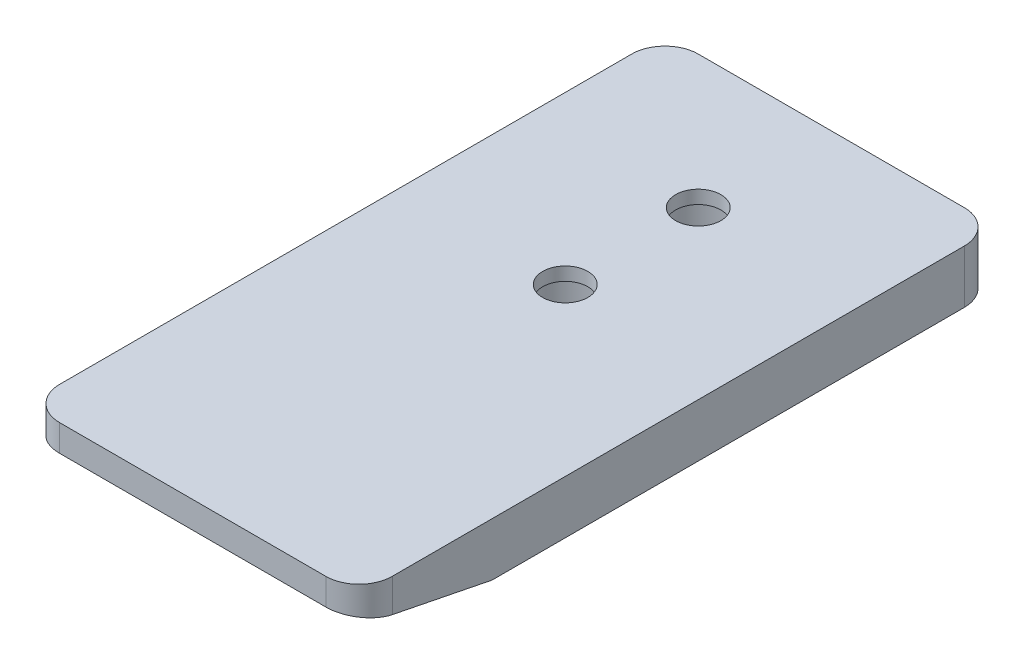
ISO-10303-21;
HEADER;
FILE_DESCRIPTION(('STEP AP214'),'2;1');
FILE_NAME('part.step','',(''),(''),'','','');
FILE_SCHEMA(('AUTOMOTIVE_DESIGN { 1 0 10303 214 1 1 1 1 }'));
ENDSEC;
DATA;
#1=APPLICATION_CONTEXT('core data for automotive mechanical design processes');
#2=APPLICATION_PROTOCOL_DEFINITION('international standard','automotive_design',2000,#1);
#3=PRODUCT_CONTEXT('',#1,'mechanical');
#4=PRODUCT('Part','Part','',(#3));
#5=PRODUCT_RELATED_PRODUCT_CATEGORY('part','',(#4));
#6=PRODUCT_DEFINITION_FORMATION('','',#4);
#7=PRODUCT_DEFINITION_CONTEXT('part definition',#1,'design');
#8=PRODUCT_DEFINITION('design','',#6,#7);
#9=PRODUCT_DEFINITION_SHAPE('','',#8);
#10=(LENGTH_UNIT() NAMED_UNIT(*) SI_UNIT(.MILLI.,.METRE.));
#11=(NAMED_UNIT(*) PLANE_ANGLE_UNIT() SI_UNIT($,.RADIAN.));
#12=(NAMED_UNIT(*) SI_UNIT($,.STERADIAN.) SOLID_ANGLE_UNIT());
#13=UNCERTAINTY_MEASURE_WITH_UNIT(LENGTH_MEASURE(1.E-05),#10,'distance_accuracy_value','');
#14=(GEOMETRIC_REPRESENTATION_CONTEXT(3) GLOBAL_UNCERTAINTY_ASSIGNED_CONTEXT((#13)) GLOBAL_UNIT_ASSIGNED_CONTEXT((#10,
#11,#12)) REPRESENTATION_CONTEXT('',''));
#15=CARTESIAN_POINT('',(0.,0.,0.));
#16=DIRECTION('',(0.,0.,1.));
#17=DIRECTION('',(1.,0.,0.));
#18=AXIS2_PLACEMENT_3D('',#15,#16,#17);
#19=CARTESIAN_POINT('',(0.,4.,0.));
#20=DIRECTION('',(1.,0.,0.));
#21=DIRECTION('',(0.,0.,-1.));
#22=AXIS2_PLACEMENT_3D('',#19,#20,#21);
#23=PLANE('',#22);
#24=DIRECTION('',(0.,-0.196116135138181,-0.980580675690921));
#25=VECTOR('',#24,1.);
#26=CARTESIAN_POINT('',(0.,2.,18.));
#27=LINE('',#26,#25);
#28=CARTESIAN_POINT('',(0.,0.,7.99999999999982));
#29=VERTEX_POINT('',#28);
#30=CARTESIAN_POINT('',(0.,1.50000000000001,15.5));
#31=VERTEX_POINT('',#30);
#32=EDGE_CURVE('E153',#29,#31,#27,.F.);
#33=ORIENTED_EDGE('',*,*,#32,.T.);
#34=DIRECTION('',(0.,-1.,0.));
#35=VECTOR('',#34,1.);
#36=CARTESIAN_POINT('',(0.,4.,15.5));
#37=LINE('',#36,#35);
#38=CARTESIAN_POINT('',(0.,4.,15.5));
#39=VERTEX_POINT('',#38);
#40=EDGE_CURVE('E179',#31,#39,#37,.F.);
#41=ORIENTED_EDGE('',*,*,#40,.T.);
#42=DIRECTION('',(0.,0.,1.));
#43=VECTOR('',#42,1.);
#44=CARTESIAN_POINT('',(0.,4.,0.));
#45=LINE('',#44,#43);
#46=CARTESIAN_POINT('',(0.,4.,-27.5));
#47=VERTEX_POINT('',#46);
#48=EDGE_CURVE('E213',#47,#39,#45,.T.);
#49=ORIENTED_EDGE('',*,*,#48,.F.);
#50=DIRECTION('',(0.,-1.,0.));
#51=VECTOR('',#50,1.);
#52=CARTESIAN_POINT('',(0.,4.,-27.5));
#53=LINE('',#52,#51);
#54=CARTESIAN_POINT('',(0.,0.,-27.5));
#55=VERTEX_POINT('',#54);
#56=EDGE_CURVE('E175',#47,#55,#53,.T.);
#57=ORIENTED_EDGE('',*,*,#56,.T.);
#58=DIRECTION('',(0.,0.,1.));
#59=VECTOR('',#58,1.);
#60=CARTESIAN_POINT('',(0.,0.,0.));
#61=LINE('',#60,#59);
#62=EDGE_CURVE('E148',#55,#29,#61,.T.);
#63=ORIENTED_EDGE('',*,*,#62,.T.);
#64=EDGE_LOOP('',(#33,#41,#49,#57,#63));
#65=FACE_BOUND('',#64,.T.);
#66=ADVANCED_FACE('F52',(#65),#23,.F.);
#67=CARTESIAN_POINT('',(25.,4.,0.));
#68=DIRECTION('',(-1.,0.,0.));
#69=DIRECTION('',(0.,0.,1.));
#70=AXIS2_PLACEMENT_3D('',#67,#68,#69);
#71=PLANE('',#70);
#72=DIRECTION('',(0.,0.,-1.));
#73=VECTOR('',#72,1.);
#74=CARTESIAN_POINT('',(25.,4.,0.));
#75=LINE('',#74,#73);
#76=CARTESIAN_POINT('',(25.,4.,15.5));
#77=VERTEX_POINT('',#76);
#78=CARTESIAN_POINT('',(25.,4.,-27.5));
#79=VERTEX_POINT('',#78);
#80=EDGE_CURVE('E219',#77,#79,#75,.T.);
#81=ORIENTED_EDGE('',*,*,#80,.F.);
#82=DIRECTION('',(0.,1.,0.));
#83=VECTOR('',#82,1.);
#84=CARTESIAN_POINT('',(25.,2.,15.5));
#85=LINE('',#84,#83);
#86=CARTESIAN_POINT('',(25.,1.50000000000001,15.5));
#87=VERTEX_POINT('',#86);
#88=EDGE_CURVE('E135',#77,#87,#85,.F.);
#89=ORIENTED_EDGE('',*,*,#88,.T.);
#90=DIRECTION('',(0.,0.196116135138181,0.980580675690921));
#91=VECTOR('',#90,1.);
#92=CARTESIAN_POINT('',(25.,2.,18.));
#93=LINE('',#92,#91);
#94=CARTESIAN_POINT('',(25.,0.,7.99999999999982));
#95=VERTEX_POINT('',#94);
#96=EDGE_CURVE('E129',#87,#95,#93,.F.);
#97=ORIENTED_EDGE('',*,*,#96,.T.);
#98=DIRECTION('',(0.,0.,-1.));
#99=VECTOR('',#98,1.);
#100=CARTESIAN_POINT('',(25.,0.,0.));
#101=LINE('',#100,#99);
#102=CARTESIAN_POINT('',(25.,0.,-27.5));
#103=VERTEX_POINT('',#102);
#104=EDGE_CURVE('E133',#95,#103,#101,.T.);
#105=ORIENTED_EDGE('',*,*,#104,.T.);
#106=DIRECTION('',(0.,-1.,0.));
#107=VECTOR('',#106,1.);
#108=CARTESIAN_POINT('',(25.,4.,-27.5));
#109=LINE('',#108,#107);
#110=EDGE_CURVE('E194',#103,#79,#109,.F.);
#111=ORIENTED_EDGE('',*,*,#110,.T.);
#112=EDGE_LOOP('',(#81,#89,#97,#105,#111));
#113=FACE_BOUND('',#112,.T.);
#114=ADVANCED_FACE('F132',(#113),#71,.F.);
#115=CARTESIAN_POINT('',(0.,4.,-30.));
#116=DIRECTION('',(0.,0.,1.));
#117=DIRECTION('',(1.,0.,0.));
#118=AXIS2_PLACEMENT_3D('',#115,#116,#117);
#119=PLANE('',#118);
#120=DIRECTION('',(-1.,0.,0.));
#121=VECTOR('',#120,1.);
#122=CARTESIAN_POINT('',(0.,0.,-30.));
#123=LINE('',#122,#121);
#124=CARTESIAN_POINT('',(22.5,0.,-30.));
#125=VERTEX_POINT('',#124);
#126=CARTESIAN_POINT('',(2.5,0.,-30.));
#127=VERTEX_POINT('',#126);
#128=EDGE_CURVE('E147',#125,#127,#123,.T.);
#129=ORIENTED_EDGE('',*,*,#128,.T.);
#130=DIRECTION('',(0.,-1.,0.));
#131=VECTOR('',#130,1.);
#132=CARTESIAN_POINT('',(2.5,4.,-30.));
#133=LINE('',#132,#131);
#134=CARTESIAN_POINT('',(2.5,4.,-30.));
#135=VERTEX_POINT('',#134);
#136=EDGE_CURVE('E11',#127,#135,#133,.F.);
#137=ORIENTED_EDGE('',*,*,#136,.T.);
#138=DIRECTION('',(-1.,0.,0.));
#139=VECTOR('',#138,1.);
#140=CARTESIAN_POINT('',(0.,4.,-30.));
#141=LINE('',#140,#139);
#142=CARTESIAN_POINT('',(22.5,4.,-30.));
#143=VERTEX_POINT('',#142);
#144=EDGE_CURVE('E210',#143,#135,#141,.T.);
#145=ORIENTED_EDGE('',*,*,#144,.F.);
#146=DIRECTION('',(0.,-1.,0.));
#147=VECTOR('',#146,1.);
#148=CARTESIAN_POINT('',(22.5,4.,-30.));
#149=LINE('',#148,#147);
#150=EDGE_CURVE('E61',#143,#125,#149,.T.);
#151=ORIENTED_EDGE('',*,*,#150,.T.);
#152=EDGE_LOOP('',(#129,#137,#145,#151));
#153=FACE_BOUND('',#152,.T.);
#154=ADVANCED_FACE('F207',(#153),#119,.F.);
#155=CARTESIAN_POINT('',(0.,4.,0.));
#156=DIRECTION('',(0.,-1.,0.));
#157=DIRECTION('',(0.,0.,-1.));
#158=AXIS2_PLACEMENT_3D('',#155,#156,#157);
#159=PLANE('',#158);
#160=CARTESIAN_POINT('',(12.5,4.,-20.));
#161=DIRECTION('',(0.,-1.,0.));
#162=DIRECTION('',(0.,0.,-1.));
#163=AXIS2_PLACEMENT_3D('',#160,#161,#162);
#164=CIRCLE('',#163,1.7);
#165=CARTESIAN_POINT('',(12.5,4.,-21.7));
#166=VERTEX_POINT('',#165);
#167=EDGE_CURVE('E257',#166,#166,#164,.T.);
#168=ORIENTED_EDGE('',*,*,#167,.T.);
#169=EDGE_LOOP('',(#168));
#170=FACE_BOUND('',#169,.T.);
#171=CARTESIAN_POINT('',(12.5,4.,-10.));
#172=DIRECTION('',(0.,-1.,0.));
#173=DIRECTION('',(0.,0.,-1.));
#174=AXIS2_PLACEMENT_3D('',#171,#172,#173);
#175=CIRCLE('',#174,1.7);
#176=CARTESIAN_POINT('',(12.5,4.,-11.7));
#177=VERTEX_POINT('',#176);
#178=EDGE_CURVE('E236',#177,#177,#175,.T.);
#179=ORIENTED_EDGE('',*,*,#178,.T.);
#180=EDGE_LOOP('',(#179));
#181=FACE_BOUND('',#180,.T.);
#182=ORIENTED_EDGE('',*,*,#48,.T.);
#183=CARTESIAN_POINT('',(2.5,4.,15.5));
#184=DIRECTION('',(0.,-1.,0.));
#185=DIRECTION('',(0.,0.,-1.));
#186=AXIS2_PLACEMENT_3D('',#183,#184,#185);
#187=CIRCLE('',#186,2.5);
#188=CARTESIAN_POINT('',(2.5,4.,18.));
#189=VERTEX_POINT('',#188);
#190=EDGE_CURVE('E191',#39,#189,#187,.F.);
#191=ORIENTED_EDGE('',*,*,#190,.T.);
#192=DIRECTION('',(-1.,0.,0.));
#193=VECTOR('',#192,1.);
#194=CARTESIAN_POINT('',(25.,4.,18.));
#195=LINE('',#194,#193);
#196=CARTESIAN_POINT('',(22.5,4.,18.));
#197=VERTEX_POINT('',#196);
#198=EDGE_CURVE('E272',#197,#189,#195,.T.);
#199=ORIENTED_EDGE('',*,*,#198,.F.);
#200=CARTESIAN_POINT('',(22.5,4.,15.5));
#201=DIRECTION('',(0.,-1.,0.));
#202=DIRECTION('',(0.,0.,-1.));
#203=AXIS2_PLACEMENT_3D('',#200,#201,#202);
#204=CIRCLE('',#203,2.5);
#205=EDGE_CURVE('E188',#197,#77,#204,.F.);
#206=ORIENTED_EDGE('',*,*,#205,.T.);
#207=ORIENTED_EDGE('',*,*,#80,.T.);
#208=CARTESIAN_POINT('',(22.5,4.,-27.5));
#209=DIRECTION('',(0.,-1.,0.));
#210=DIRECTION('',(0.,0.,-1.));
#211=AXIS2_PLACEMENT_3D('',#208,#209,#210);
#212=CIRCLE('',#211,2.5);
#213=EDGE_CURVE('E182',#79,#143,#212,.F.);
#214=ORIENTED_EDGE('',*,*,#213,.T.);
#215=ORIENTED_EDGE('',*,*,#144,.T.);
#216=CARTESIAN_POINT('',(2.5,4.,-27.5));
#217=DIRECTION('',(0.,-1.,0.));
#218=DIRECTION('',(0.,0.,-1.));
#219=AXIS2_PLACEMENT_3D('',#216,#217,#218);
#220=CIRCLE('',#219,2.5);
#221=EDGE_CURVE('E185',#135,#47,#220,.F.);
#222=ORIENTED_EDGE('',*,*,#221,.T.);
#223=EDGE_LOOP('',(#182,#191,#199,#206,#207,#214,#215,#222));
#224=FACE_BOUND('',#223,.T.);
#225=ADVANCED_FACE('F285',(#170,#181,#224),#159,.F.);
#226=CARTESIAN_POINT('',(0.,0.,0.));
#227=DIRECTION('',(0.,-1.,0.));
#228=DIRECTION('',(0.,0.,-1.));
#229=AXIS2_PLACEMENT_3D('',#226,#227,#228);
#230=PLANE('',#229);
#231=CARTESIAN_POINT('',(12.5,0.,-20.));
#232=DIRECTION('',(0.,-1.,0.));
#233=DIRECTION('',(0.,0.,-1.));
#234=AXIS2_PLACEMENT_3D('',#231,#232,#233);
#235=CIRCLE('',#234,3.25);
#236=CARTESIAN_POINT('',(12.5,0.,-23.25));
#237=VERTEX_POINT('',#236);
#238=EDGE_CURVE('E268',#237,#237,#235,.T.);
#239=ORIENTED_EDGE('',*,*,#238,.F.);
#240=EDGE_LOOP('',(#239));
#241=FACE_BOUND('',#240,.T.);
#242=CARTESIAN_POINT('',(12.5,0.,-10.));
#243=DIRECTION('',(0.,-1.,0.));
#244=DIRECTION('',(0.,0.,-1.));
#245=AXIS2_PLACEMENT_3D('',#242,#243,#244);
#246=CIRCLE('',#245,3.25);
#247=CARTESIAN_POINT('',(12.5,0.,-13.25));
#248=VERTEX_POINT('',#247);
#249=EDGE_CURVE('E253',#248,#248,#246,.T.);
#250=ORIENTED_EDGE('',*,*,#249,.F.);
#251=EDGE_LOOP('',(#250));
#252=FACE_BOUND('',#251,.T.);
#253=ORIENTED_EDGE('',*,*,#62,.F.);
#254=CARTESIAN_POINT('',(2.5,0.,-27.5));
#255=DIRECTION('',(0.,-1.,0.));
#256=DIRECTION('',(0.,0.,-1.));
#257=AXIS2_PLACEMENT_3D('',#254,#255,#256);
#258=CIRCLE('',#257,2.5);
#259=EDGE_CURVE('E71',#55,#127,#258,.T.);
#260=ORIENTED_EDGE('',*,*,#259,.T.);
#261=ORIENTED_EDGE('',*,*,#128,.F.);
#262=CARTESIAN_POINT('',(22.5,0.,-27.5));
#263=DIRECTION('',(0.,-1.,0.));
#264=DIRECTION('',(0.,0.,-1.));
#265=AXIS2_PLACEMENT_3D('',#262,#263,#264);
#266=CIRCLE('',#265,2.5);
#267=EDGE_CURVE('E79',#125,#103,#266,.T.);
#268=ORIENTED_EDGE('',*,*,#267,.T.);
#269=ORIENTED_EDGE('',*,*,#104,.F.);
#270=DIRECTION('',(-1.,0.,0.));
#271=VECTOR('',#270,1.);
#272=CARTESIAN_POINT('',(0.,0.,7.99999999999982));
#273=LINE('',#272,#271);
#274=EDGE_CURVE('E140',#95,#29,#273,.T.);
#275=ORIENTED_EDGE('',*,*,#274,.T.);
#276=EDGE_LOOP('',(#253,#260,#261,#268,#269,#275));
#277=FACE_BOUND('',#276,.T.);
#278=ADVANCED_FACE('F144',(#241,#252,#277),#230,.T.);
#279=CARTESIAN_POINT('',(12.5,0.,-10.));
#280=DIRECTION('',(0.,-1.,0.));
#281=DIRECTION('',(0.,0.,-1.));
#282=AXIS2_PLACEMENT_3D('',#279,#280,#281);
#283=CYLINDRICAL_SURFACE('',#282,1.70000000000001);
#284=ORIENTED_EDGE('',*,*,#178,.F.);
#285=EDGE_LOOP('',(#284));
#286=FACE_BOUND('',#285,.T.);
#287=CARTESIAN_POINT('',(12.5,3.,-10.));
#288=DIRECTION('',(0.,-1.,0.));
#289=DIRECTION('',(0.,0.,-1.));
#290=AXIS2_PLACEMENT_3D('',#287,#288,#289);
#291=CIRCLE('',#290,1.70000000000001);
#292=CARTESIAN_POINT('',(12.5,3.,-11.7));
#293=VERTEX_POINT('',#292);
#294=EDGE_CURVE('E240',#293,#293,#291,.T.);
#295=ORIENTED_EDGE('',*,*,#294,.T.);
#296=EDGE_LOOP('',(#295));
#297=FACE_BOUND('',#296,.T.);
#298=ADVANCED_FACE('F371',(#286,#297),#283,.F.);
#299=CARTESIAN_POINT('',(14.2,3.,-10.));
#300=DIRECTION('',(0.,1.,0.));
#301=DIRECTION('',(0.,0.,1.));
#302=AXIS2_PLACEMENT_3D('',#299,#300,#301);
#303=PLANE('',#302);
#304=ORIENTED_EDGE('',*,*,#294,.F.);
#305=EDGE_LOOP('',(#304));
#306=FACE_BOUND('',#305,.T.);
#307=CARTESIAN_POINT('',(12.5,3.,-10.));
#308=DIRECTION('',(0.,-1.,0.));
#309=DIRECTION('',(0.,0.,-1.));
#310=AXIS2_PLACEMENT_3D('',#307,#308,#309);
#311=CIRCLE('',#310,3.25);
#312=CARTESIAN_POINT('',(12.5,3.,-13.25));
#313=VERTEX_POINT('',#312);
#314=EDGE_CURVE('E247',#313,#313,#311,.T.);
#315=ORIENTED_EDGE('',*,*,#314,.T.);
#316=EDGE_LOOP('',(#315));
#317=FACE_BOUND('',#316,.T.);
#318=ADVANCED_FACE('F444',(#306,#317),#303,.F.);
#319=CARTESIAN_POINT('',(12.5,0.,-10.));
#320=DIRECTION('',(0.,-1.,0.));
#321=DIRECTION('',(0.,0.,-1.));
#322=AXIS2_PLACEMENT_3D('',#319,#320,#321);
#323=CYLINDRICAL_SURFACE('',#322,3.25);
#324=ORIENTED_EDGE('',*,*,#314,.F.);
#325=EDGE_LOOP('',(#324));
#326=FACE_BOUND('',#325,.T.);
#327=ORIENTED_EDGE('',*,*,#249,.T.);
#328=EDGE_LOOP('',(#327));
#329=FACE_BOUND('',#328,.T.);
#330=ADVANCED_FACE('F434',(#326,#329),#323,.F.);
#331=CARTESIAN_POINT('',(12.5,0.,-20.));
#332=DIRECTION('',(0.,-1.,0.));
#333=DIRECTION('',(0.,0.,-1.));
#334=AXIS2_PLACEMENT_3D('',#331,#332,#333);
#335=CYLINDRICAL_SURFACE('',#334,1.70000000000001);
#336=ORIENTED_EDGE('',*,*,#167,.F.);
#337=EDGE_LOOP('',(#336));
#338=FACE_BOUND('',#337,.T.);
#339=CARTESIAN_POINT('',(12.5,3.,-20.));
#340=DIRECTION('',(0.,-1.,0.));
#341=DIRECTION('',(0.,0.,-1.));
#342=AXIS2_PLACEMENT_3D('',#339,#340,#341);
#343=CIRCLE('',#342,1.70000000000001);
#344=CARTESIAN_POINT('',(12.5,3.,-21.7));
#345=VERTEX_POINT('',#344);
#346=EDGE_CURVE('E261',#345,#345,#343,.T.);
#347=ORIENTED_EDGE('',*,*,#346,.T.);
#348=EDGE_LOOP('',(#347));
#349=FACE_BOUND('',#348,.T.);
#350=ADVANCED_FACE('F424',(#338,#349),#335,.F.);
#351=CARTESIAN_POINT('',(14.2,3.,-20.));
#352=DIRECTION('',(0.,1.,0.));
#353=DIRECTION('',(0.,0.,1.));
#354=AXIS2_PLACEMENT_3D('',#351,#352,#353);
#355=PLANE('',#354);
#356=ORIENTED_EDGE('',*,*,#346,.F.);
#357=EDGE_LOOP('',(#356));
#358=FACE_BOUND('',#357,.T.);
#359=CARTESIAN_POINT('',(12.5,3.,-20.));
#360=DIRECTION('',(0.,-1.,0.));
#361=DIRECTION('',(0.,0.,-1.));
#362=AXIS2_PLACEMENT_3D('',#359,#360,#361);
#363=CIRCLE('',#362,3.25);
#364=CARTESIAN_POINT('',(12.5,3.,-23.25));
#365=VERTEX_POINT('',#364);
#366=EDGE_CURVE('E265',#365,#365,#363,.T.);
#367=ORIENTED_EDGE('',*,*,#366,.T.);
#368=EDGE_LOOP('',(#367));
#369=FACE_BOUND('',#368,.T.);
#370=ADVANCED_FACE('F414',(#358,#369),#355,.F.);
#371=CARTESIAN_POINT('',(12.5,0.,-20.));
#372=DIRECTION('',(0.,-1.,0.));
#373=DIRECTION('',(0.,0.,-1.));
#374=AXIS2_PLACEMENT_3D('',#371,#372,#373);
#375=CYLINDRICAL_SURFACE('',#374,3.25);
#376=ORIENTED_EDGE('',*,*,#366,.F.);
#377=EDGE_LOOP('',(#376));
#378=FACE_BOUND('',#377,.T.);
#379=ORIENTED_EDGE('',*,*,#238,.T.);
#380=EDGE_LOOP('',(#379));
#381=FACE_BOUND('',#380,.T.);
#382=ADVANCED_FACE('F360',(#378,#381),#375,.F.);
#383=CARTESIAN_POINT('',(0.,0.,18.));
#384=DIRECTION('',(0.,0.,1.));
#385=DIRECTION('',(1.,0.,0.));
#386=AXIS2_PLACEMENT_3D('',#383,#384,#385);
#387=PLANE('',#386);
#388=ORIENTED_EDGE('',*,*,#198,.T.);
#389=DIRECTION('',(0.,-1.,0.));
#390=VECTOR('',#389,1.);
#391=CARTESIAN_POINT('',(2.5,2.,18.));
#392=LINE('',#391,#390);
#393=CARTESIAN_POINT('',(2.5,2.,18.));
#394=VERTEX_POINT('',#393);
#395=EDGE_CURVE('E165',#189,#394,#392,.T.);
#396=ORIENTED_EDGE('',*,*,#395,.T.);
#397=DIRECTION('',(1.,0.,0.));
#398=VECTOR('',#397,1.);
#399=CARTESIAN_POINT('',(0.,2.,18.));
#400=LINE('',#399,#398);
#401=CARTESIAN_POINT('',(22.5,2.,18.));
#402=VERTEX_POINT('',#401);
#403=EDGE_CURVE('E141',#394,#402,#400,.T.);
#404=ORIENTED_EDGE('',*,*,#403,.T.);
#405=DIRECTION('',(0.,1.,0.));
#406=VECTOR('',#405,1.);
#407=CARTESIAN_POINT('',(22.5,4.,18.));
#408=LINE('',#407,#406);
#409=EDGE_CURVE('E158',#402,#197,#408,.T.);
#410=ORIENTED_EDGE('',*,*,#409,.T.);
#411=EDGE_LOOP('',(#388,#396,#404,#410));
#412=FACE_BOUND('',#411,.T.);
#413=ADVANCED_FACE('F278',(#412),#387,.T.);
#414=CARTESIAN_POINT('',(0.,2.,18.));
#415=DIRECTION('',(0.,0.980580675690921,-0.196116135138181));
#416=DIRECTION('',(1.,0.,0.));
#417=AXIS2_PLACEMENT_3D('',#414,#415,#416);
#418=PLANE('',#417);
#419=ORIENTED_EDGE('',*,*,#403,.F.);
#420=CARTESIAN_POINT('',(2.5,1.50000000000001,15.5));
#421=DIRECTION('',(0.,0.980580675690921,-0.196116135138181));
#422=DIRECTION('',(0.,0.196116135138181,0.980580675690921));
#423=AXIS2_PLACEMENT_3D('',#420,#421,#422);
#424=ELLIPSE('',#423,2.54950975679639,2.5);
#425=EDGE_CURVE('E172',#394,#31,#424,.F.);
#426=ORIENTED_EDGE('',*,*,#425,.T.);
#427=ORIENTED_EDGE('',*,*,#32,.F.);
#428=ORIENTED_EDGE('',*,*,#274,.F.);
#429=ORIENTED_EDGE('',*,*,#96,.F.);
#430=CARTESIAN_POINT('',(22.5,1.50000000000001,15.5));
#431=DIRECTION('',(0.,0.980580675690921,-0.196116135138181));
#432=DIRECTION('',(0.,-0.196116135138181,-0.980580675690921));
#433=AXIS2_PLACEMENT_3D('',#430,#431,#432);
#434=ELLIPSE('',#433,2.54950975679639,2.5);
#435=EDGE_CURVE('E169',#87,#402,#434,.F.);
#436=ORIENTED_EDGE('',*,*,#435,.T.);
#437=EDGE_LOOP('',(#419,#426,#427,#428,#429,#436));
#438=FACE_BOUND('',#437,.T.);
#439=ADVANCED_FACE('F151',(#438),#418,.F.);
#440=CARTESIAN_POINT('',(2.5,0.,15.5));
#441=DIRECTION('',(0.,1.,0.));
#442=DIRECTION('',(0.,0.,1.));
#443=AXIS2_PLACEMENT_3D('',#440,#441,#442);
#444=CYLINDRICAL_SURFACE('',#443,2.5);
#445=ORIENTED_EDGE('',*,*,#190,.F.);
#446=ORIENTED_EDGE('',*,*,#40,.F.);
#447=ORIENTED_EDGE('',*,*,#425,.F.);
#448=ORIENTED_EDGE('',*,*,#395,.F.);
#449=EDGE_LOOP('',(#445,#446,#447,#448));
#450=FACE_BOUND('',#449,.T.);
#451=ADVANCED_FACE('F281',(#450),#444,.T.);
#452=CARTESIAN_POINT('',(22.5,0.,15.5));
#453=DIRECTION('',(0.,-1.,0.));
#454=DIRECTION('',(0.,0.,-1.));
#455=AXIS2_PLACEMENT_3D('',#452,#453,#454);
#456=CYLINDRICAL_SURFACE('',#455,2.5);
#457=ORIENTED_EDGE('',*,*,#435,.F.);
#458=ORIENTED_EDGE('',*,*,#88,.F.);
#459=ORIENTED_EDGE('',*,*,#205,.F.);
#460=ORIENTED_EDGE('',*,*,#409,.F.);
#461=EDGE_LOOP('',(#457,#458,#459,#460));
#462=FACE_BOUND('',#461,.T.);
#463=ADVANCED_FACE('F289',(#462),#456,.T.);
#464=CARTESIAN_POINT('',(2.5,4.,-27.5));
#465=DIRECTION('',(0.,-1.,0.));
#466=DIRECTION('',(0.,0.,-1.));
#467=AXIS2_PLACEMENT_3D('',#464,#465,#466);
#468=CYLINDRICAL_SURFACE('',#467,2.5);
#469=ORIENTED_EDGE('',*,*,#221,.F.);
#470=ORIENTED_EDGE('',*,*,#136,.F.);
#471=ORIENTED_EDGE('',*,*,#259,.F.);
#472=ORIENTED_EDGE('',*,*,#56,.F.);
#473=EDGE_LOOP('',(#469,#470,#471,#472));
#474=FACE_BOUND('',#473,.T.);
#475=ADVANCED_FACE('F287',(#474),#468,.T.);
#476=CARTESIAN_POINT('',(22.5,4.,-27.5));
#477=DIRECTION('',(0.,-1.,0.));
#478=DIRECTION('',(0.,0.,-1.));
#479=AXIS2_PLACEMENT_3D('',#476,#477,#478);
#480=CYLINDRICAL_SURFACE('',#479,2.5);
#481=ORIENTED_EDGE('',*,*,#213,.F.);
#482=ORIENTED_EDGE('',*,*,#110,.F.);
#483=ORIENTED_EDGE('',*,*,#267,.F.);
#484=ORIENTED_EDGE('',*,*,#150,.F.);
#485=EDGE_LOOP('',(#481,#482,#483,#484));
#486=FACE_BOUND('',#485,.T.);
#487=ADVANCED_FACE('F54',(#486),#480,.T.);
#488=CLOSED_SHELL('',(#66,#114,#154,#225,#278,#298,#318,#330,#350,#370,#382,#413,#439,#451,#463,
#475,#487));
#489=MANIFOLD_SOLID_BREP('B2',#488);
#490=ADVANCED_BREP_SHAPE_REPRESENTATION('',(#18,#489),#14);
#491=SHAPE_DEFINITION_REPRESENTATION(#9,#490);
ENDSEC;
END-ISO-10303-21;
